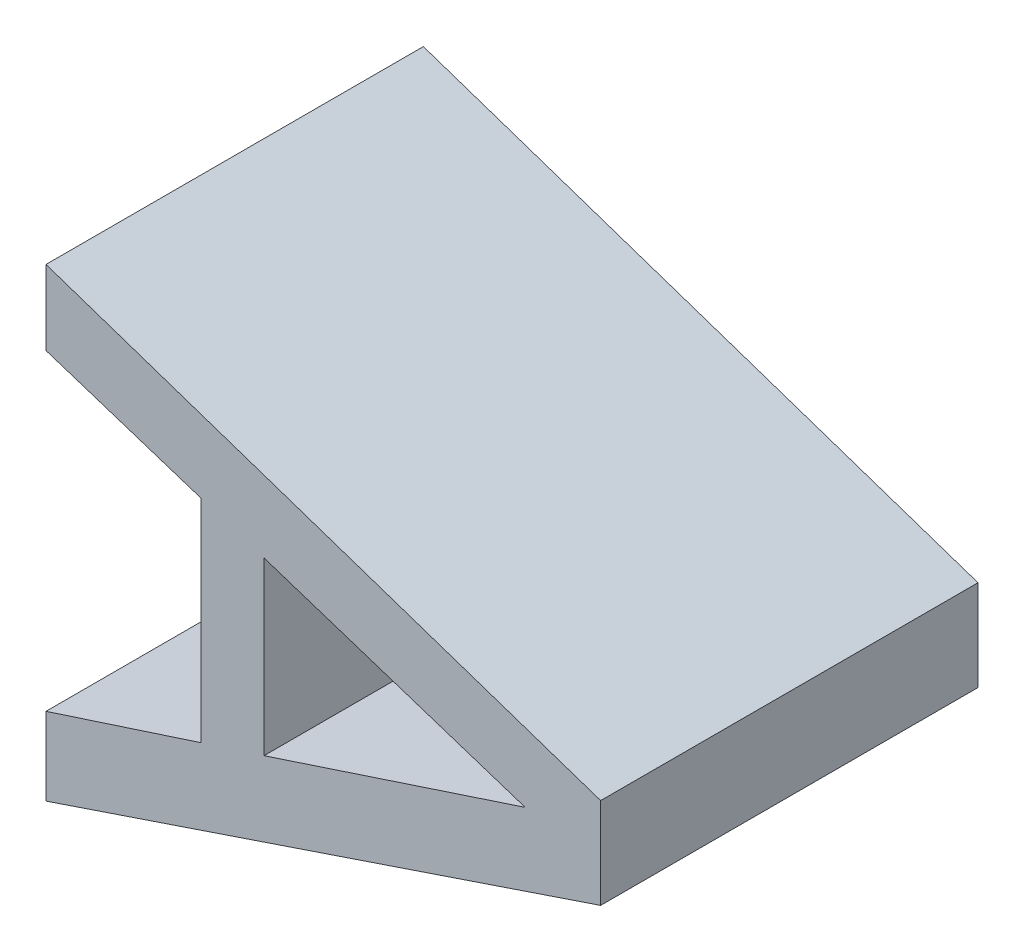
ISO-10303-21;
HEADER;
FILE_DESCRIPTION(('STEP AP214'),'2;1');
FILE_NAME('part.step','',(''),(''),'','','');
FILE_SCHEMA(('AUTOMOTIVE_DESIGN { 1 0 10303 214 1 1 1 1 }'));
ENDSEC;
DATA;
#1=APPLICATION_CONTEXT('core data for automotive mechanical design processes');
#2=APPLICATION_PROTOCOL_DEFINITION('international standard','automotive_design',2000,#1);
#3=PRODUCT_CONTEXT('',#1,'mechanical');
#4=PRODUCT('Part','Part','',(#3));
#5=PRODUCT_RELATED_PRODUCT_CATEGORY('part','',(#4));
#6=PRODUCT_DEFINITION_FORMATION('','',#4);
#7=PRODUCT_DEFINITION_CONTEXT('part definition',#1,'design');
#8=PRODUCT_DEFINITION('design','',#6,#7);
#9=PRODUCT_DEFINITION_SHAPE('','',#8);
#10=(LENGTH_UNIT() NAMED_UNIT(*) SI_UNIT(.MILLI.,.METRE.));
#11=(NAMED_UNIT(*) PLANE_ANGLE_UNIT() SI_UNIT($,.RADIAN.));
#12=(NAMED_UNIT(*) SI_UNIT($,.STERADIAN.) SOLID_ANGLE_UNIT());
#13=UNCERTAINTY_MEASURE_WITH_UNIT(LENGTH_MEASURE(1.E-05),#10,'distance_accuracy_value','');
#14=(GEOMETRIC_REPRESENTATION_CONTEXT(3) GLOBAL_UNCERTAINTY_ASSIGNED_CONTEXT((#13)) GLOBAL_UNIT_ASSIGNED_CONTEXT((#10,
#11,#12)) REPRESENTATION_CONTEXT('',''));
#15=CARTESIAN_POINT('',(0.,0.,0.));
#16=DIRECTION('',(0.,0.,1.));
#17=DIRECTION('',(1.,0.,0.));
#18=AXIS2_PLACEMENT_3D('',#15,#16,#17);
#19=CARTESIAN_POINT('',(-0.14056293363183,-1.23494373197261,0.));
#20=DIRECTION('',(-1.,0.,0.));
#21=DIRECTION('',(0.,-1.,0.));
#22=AXIS2_PLACEMENT_3D('',#19,#20,#21);
#23=PLANE('',#22);
#24=DIRECTION('',(0.,-1.,0.));
#25=VECTOR('',#24,1.);
#26=CARTESIAN_POINT('',(-0.14056293363183,-1.23494373197261,0.));
#27=LINE('',#26,#25);
#28=CARTESIAN_POINT('',(-0.14056293363183,-1.23494373197261,0.));
#29=VERTEX_POINT('',#28);
#30=CARTESIAN_POINT('',(-0.14056293363183,-1.28033028319837,0.));
#31=VERTEX_POINT('',#30);
#32=EDGE_CURVE('E11',#29,#31,#27,.T.);
#33=ORIENTED_EDGE('',*,*,#32,.F.);
#34=DIRECTION('',(0.,0.,1.));
#35=VECTOR('',#34,1.);
#36=CARTESIAN_POINT('',(-0.14056293363183,-1.23494373197261,0.));
#37=LINE('',#36,#35);
#38=CARTESIAN_POINT('',(-0.14056293363183,-1.23494373197261,0.1));
#39=VERTEX_POINT('',#38);
#40=EDGE_CURVE('E190',#29,#39,#37,.T.);
#41=ORIENTED_EDGE('',*,*,#40,.T.);
#42=DIRECTION('',(0.,1.,0.));
#43=VECTOR('',#42,1.);
#44=CARTESIAN_POINT('',(-0.14056293363183,-1.28033028319837,0.1));
#45=LINE('',#44,#43);
#46=CARTESIAN_POINT('',(-0.14056293363183,-1.28033028319837,0.1));
#47=VERTEX_POINT('',#46);
#48=EDGE_CURVE('E182',#47,#39,#45,.T.);
#49=ORIENTED_EDGE('',*,*,#48,.F.);
#50=DIRECTION('',(0.,0.,1.));
#51=VECTOR('',#50,1.);
#52=CARTESIAN_POINT('',(-0.14056293363183,-1.28033028319837,0.));
#53=LINE('',#52,#51);
#54=EDGE_CURVE('E176',#31,#47,#53,.T.);
#55=ORIENTED_EDGE('',*,*,#54,.F.);
#56=EDGE_LOOP('',(#33,#41,#49,#55));
#57=FACE_BOUND('',#56,.T.);
#58=ADVANCED_FACE('F17',(#57),#23,.F.);
#59=CARTESIAN_POINT('',(-0.0713514211327046,-1.2575774451823,0.));
#60=DIRECTION('',(0.310824121666868,0.95046744572869,0.));
#61=DIRECTION('',(-0.95046744572869,0.310824121666868,0.));
#62=AXIS2_PLACEMENT_3D('',#59,#60,#61);
#63=PLANE('',#62);
#64=DIRECTION('',(-0.95046744572869,0.310824121666869,0.));
#65=VECTOR('',#64,1.);
#66=CARTESIAN_POINT('',(-0.0713514211327044,-1.2575774451823,0.));
#67=LINE('',#66,#65);
#68=CARTESIAN_POINT('',(-0.0713514211327046,-1.2575774451823,0.));
#69=VERTEX_POINT('',#68);
#70=EDGE_CURVE('E24',#69,#29,#67,.T.);
#71=ORIENTED_EDGE('',*,*,#70,.F.);
#72=DIRECTION('',(0.,0.,1.));
#73=VECTOR('',#72,1.);
#74=CARTESIAN_POINT('',(-0.0713514211327046,-1.2575774451823,0.));
#75=LINE('',#74,#73);
#76=CARTESIAN_POINT('',(-0.0713514211327046,-1.2575774451823,0.1));
#77=VERTEX_POINT('',#76);
#78=EDGE_CURVE('E185',#69,#77,#75,.T.);
#79=ORIENTED_EDGE('',*,*,#78,.T.);
#80=DIRECTION('',(0.950467445728691,-0.310824121666866,0.));
#81=VECTOR('',#80,1.);
#82=CARTESIAN_POINT('',(-0.140562933631828,-1.2349437319726,0.1));
#83=LINE('',#82,#81);
#84=EDGE_CURVE('E173',#39,#77,#83,.T.);
#85=ORIENTED_EDGE('',*,*,#84,.F.);
#86=ORIENTED_EDGE('',*,*,#40,.F.);
#87=EDGE_LOOP('',(#71,#79,#85,#86));
#88=FACE_BOUND('',#87,.T.);
#89=ADVANCED_FACE('F197',(#88),#63,.F.);
#90=CARTESIAN_POINT('',(-0.14056293363183,-1.28033028319837,0.));
#91=DIRECTION('',(0.312300861312514,-0.949983248285706,0.));
#92=DIRECTION('',(0.949983248285706,0.312300861312514,0.));
#93=AXIS2_PLACEMENT_3D('',#90,#91,#92);
#94=PLANE('',#93);
#95=DIRECTION('',(0.949983248285707,0.312300861312513,0.));
#96=VECTOR('',#95,1.);
#97=CARTESIAN_POINT('',(-0.140562933631831,-1.28033028319837,0.));
#98=LINE('',#97,#96);
#99=EDGE_CURVE('E187',#31,#69,#98,.T.);
#100=ORIENTED_EDGE('',*,*,#99,.F.);
#101=ORIENTED_EDGE('',*,*,#54,.T.);
#102=DIRECTION('',(-0.949983248285706,-0.312300861312515,0.));
#103=VECTOR('',#102,1.);
#104=CARTESIAN_POINT('',(-0.0713514211327036,-1.2575774451823,0.1));
#105=LINE('',#104,#103);
#106=EDGE_CURVE('E165',#77,#47,#105,.T.);
#107=ORIENTED_EDGE('',*,*,#106,.F.);
#108=ORIENTED_EDGE('',*,*,#78,.F.);
#109=EDGE_LOOP('',(#100,#101,#107,#108));
#110=FACE_BOUND('',#109,.T.);
#111=ADVANCED_FACE('F194',(#110),#94,.F.);
#112=CARTESIAN_POINT('',(-0.0513384536630779,-1.27008554985082,0.));
#113=DIRECTION('',(1.,0.,0.));
#114=DIRECTION('',(0.,1.,0.));
#115=AXIS2_PLACEMENT_3D('',#112,#113,#114);
#116=PLANE('',#115);
#117=DIRECTION('',(0.,-1.,0.));
#118=VECTOR('',#117,1.);
#119=CARTESIAN_POINT('',(-0.051338453663078,-1.24602233896472,0.));
#120=LINE('',#119,#118);
#121=CARTESIAN_POINT('',(-0.051338453663078,-1.24602233896472,0.));
#122=VERTEX_POINT('',#121);
#123=CARTESIAN_POINT('',(-0.0513384536630779,-1.27008554985082,0.));
#124=VERTEX_POINT('',#123);
#125=EDGE_CURVE('E179',#122,#124,#120,.T.);
#126=ORIENTED_EDGE('',*,*,#125,.F.);
#127=DIRECTION('',(0.,0.,1.));
#128=VECTOR('',#127,1.);
#129=CARTESIAN_POINT('',(-0.051338453663078,-1.24602233896472,0.));
#130=LINE('',#129,#128);
#131=CARTESIAN_POINT('',(-0.051338453663078,-1.24602233896472,0.1));
#132=VERTEX_POINT('',#131);
#133=EDGE_CURVE('E168',#122,#132,#130,.T.);
#134=ORIENTED_EDGE('',*,*,#133,.T.);
#135=DIRECTION('',(0.,1.,0.));
#136=VECTOR('',#135,1.);
#137=CARTESIAN_POINT('',(-0.0513384536630779,-1.27008554985082,0.1));
#138=LINE('',#137,#136);
#139=CARTESIAN_POINT('',(-0.0513384536630779,-1.27008554985082,0.1));
#140=VERTEX_POINT('',#139);
#141=EDGE_CURVE('E123',#140,#132,#138,.T.);
#142=ORIENTED_EDGE('',*,*,#141,.F.);
#143=DIRECTION('',(0.,0.,1.));
#144=VECTOR('',#143,1.);
#145=CARTESIAN_POINT('',(-0.0513384536630779,-1.27008554985082,0.));
#146=LINE('',#145,#144);
#147=EDGE_CURVE('E160',#124,#140,#146,.T.);
#148=ORIENTED_EDGE('',*,*,#147,.F.);
#149=EDGE_LOOP('',(#126,#134,#142,#148));
#150=FACE_BOUND('',#149,.T.);
#151=ADVANCED_FACE('F204',(#150),#116,.T.);
#152=CARTESIAN_POINT('',(-0.19833846471974,-1.31964146929942,0.));
#153=DIRECTION('',(0.319451166674569,-0.947602739606771,0.));
#154=DIRECTION('',(0.947602739606771,0.319451166674569,0.));
#155=AXIS2_PLACEMENT_3D('',#152,#153,#154);
#156=PLANE('',#155);
#157=DIRECTION('',(-0.94760273960677,-0.319451166674569,0.));
#158=VECTOR('',#157,1.);
#159=CARTESIAN_POINT('',(-0.0513384536630779,-1.27008554985082,0.));
#160=LINE('',#159,#158);
#161=CARTESIAN_POINT('',(-0.198338464719739,-1.31964146929942,0.));
#162=VERTEX_POINT('',#161);
#163=EDGE_CURVE('E170',#124,#162,#160,.T.);
#164=ORIENTED_EDGE('',*,*,#163,.F.);
#165=ORIENTED_EDGE('',*,*,#147,.T.);
#166=DIRECTION('',(0.94760273960677,0.31945116667457,0.));
#167=VECTOR('',#166,1.);
#168=CARTESIAN_POINT('',(-0.198338464719739,-1.31964146929942,0.1));
#169=LINE('',#168,#167);
#170=CARTESIAN_POINT('',(-0.198338464719739,-1.31964146929942,0.1));
#171=VERTEX_POINT('',#170);
#172=EDGE_CURVE('E152',#171,#140,#169,.T.);
#173=ORIENTED_EDGE('',*,*,#172,.F.);
#174=DIRECTION('',(0.,0.,1.));
#175=VECTOR('',#174,1.);
#176=CARTESIAN_POINT('',(-0.198338464719739,-1.31964146929942,0.));
#177=LINE('',#176,#175);
#178=EDGE_CURVE('E154',#162,#171,#177,.T.);
#179=ORIENTED_EDGE('',*,*,#178,.F.);
#180=EDGE_LOOP('',(#164,#165,#173,#179));
#181=FACE_BOUND('',#180,.T.);
#182=ADVANCED_FACE('F212',(#181),#156,.T.);
#183=CARTESIAN_POINT('',(-0.198338464719739,-1.29903287779796,0.));
#184=DIRECTION('',(-1.,0.,0.));
#185=DIRECTION('',(0.,-1.,0.));
#186=AXIS2_PLACEMENT_3D('',#183,#184,#185);
#187=PLANE('',#186);
#188=DIRECTION('',(0.,1.,0.));
#189=VECTOR('',#188,1.);
#190=CARTESIAN_POINT('',(-0.198338464719739,-1.31964146929942,0.));
#191=LINE('',#190,#189);
#192=CARTESIAN_POINT('',(-0.198338464719739,-1.29903287779796,0.));
#193=VERTEX_POINT('',#192);
#194=EDGE_CURVE('E162',#162,#193,#191,.T.);
#195=ORIENTED_EDGE('',*,*,#194,.F.);
#196=ORIENTED_EDGE('',*,*,#178,.T.);
#197=DIRECTION('',(0.,-1.,0.));
#198=VECTOR('',#197,1.);
#199=CARTESIAN_POINT('',(-0.198338464719739,-1.29903287779796,0.1));
#200=LINE('',#199,#198);
#201=CARTESIAN_POINT('',(-0.198338464719739,-1.29903287779796,0.1));
#202=VERTEX_POINT('',#201);
#203=EDGE_CURVE('E144',#202,#171,#200,.T.);
#204=ORIENTED_EDGE('',*,*,#203,.F.);
#205=DIRECTION('',(0.,0.,1.));
#206=VECTOR('',#205,1.);
#207=CARTESIAN_POINT('',(-0.198338464719739,-1.29903287779796,0.));
#208=LINE('',#207,#206);
#209=EDGE_CURVE('E147',#193,#202,#208,.T.);
#210=ORIENTED_EDGE('',*,*,#209,.F.);
#211=EDGE_LOOP('',(#195,#196,#204,#210));
#212=FACE_BOUND('',#211,.T.);
#213=ADVANCED_FACE('F218',(#212),#187,.T.);
#214=CARTESIAN_POINT('',(-0.157240406523185,-1.28569089948487,0.));
#215=DIRECTION('',(-0.308774363938383,0.951135317488761,0.));
#216=DIRECTION('',(-0.951135317488761,-0.308774363938383,0.));
#217=AXIS2_PLACEMENT_3D('',#214,#215,#216);
#218=PLANE('',#217);
#219=DIRECTION('',(0.951135317488763,0.308774363938377,0.));
#220=VECTOR('',#219,1.);
#221=CARTESIAN_POINT('',(-0.198338464719739,-1.29903287779796,0.));
#222=LINE('',#221,#220);
#223=CARTESIAN_POINT('',(-0.157240406523185,-1.28569089948487,0.));
#224=VERTEX_POINT('',#223);
#225=EDGE_CURVE('E156',#193,#224,#222,.T.);
#226=ORIENTED_EDGE('',*,*,#225,.F.);
#227=ORIENTED_EDGE('',*,*,#209,.T.);
#228=DIRECTION('',(-0.951135317488762,-0.308774363938382,0.));
#229=VECTOR('',#228,1.);
#230=CARTESIAN_POINT('',(-0.157240406523183,-1.28569089948488,0.1));
#231=LINE('',#230,#229);
#232=CARTESIAN_POINT('',(-0.157240406523185,-1.28569089948487,0.1));
#233=VERTEX_POINT('',#232);
#234=EDGE_CURVE('E136',#233,#202,#231,.T.);
#235=ORIENTED_EDGE('',*,*,#234,.F.);
#236=DIRECTION('',(0.,0.,1.));
#237=VECTOR('',#236,1.);
#238=CARTESIAN_POINT('',(-0.157240406523185,-1.28569089948487,0.));
#239=LINE('',#238,#237);
#240=EDGE_CURVE('E139',#224,#233,#239,.T.);
#241=ORIENTED_EDGE('',*,*,#240,.F.);
#242=EDGE_LOOP('',(#226,#227,#235,#241));
#243=FACE_BOUND('',#242,.T.);
#244=ADVANCED_FACE('F222',(#243),#218,.T.);
#245=CARTESIAN_POINT('',(-0.157240406523185,-1.2295831156861,0.));
#246=DIRECTION('',(-1.,0.,0.));
#247=DIRECTION('',(0.,-1.,0.));
#248=AXIS2_PLACEMENT_3D('',#245,#246,#247);
#249=PLANE('',#248);
#250=DIRECTION('',(0.,1.,0.));
#251=VECTOR('',#250,1.);
#252=CARTESIAN_POINT('',(-0.157240406523185,-1.28569089948487,0.));
#253=LINE('',#252,#251);
#254=CARTESIAN_POINT('',(-0.157240406523185,-1.2295831156861,0.));
#255=VERTEX_POINT('',#254);
#256=EDGE_CURVE('E149',#224,#255,#253,.T.);
#257=ORIENTED_EDGE('',*,*,#256,.F.);
#258=ORIENTED_EDGE('',*,*,#240,.T.);
#259=DIRECTION('',(0.,-1.,0.));
#260=VECTOR('',#259,1.);
#261=CARTESIAN_POINT('',(-0.157240406523185,-1.2295831156861,0.1));
#262=LINE('',#261,#260);
#263=CARTESIAN_POINT('',(-0.157240406523185,-1.2295831156861,0.1));
#264=VERTEX_POINT('',#263);
#265=EDGE_CURVE('E129',#264,#233,#262,.T.);
#266=ORIENTED_EDGE('',*,*,#265,.F.);
#267=DIRECTION('',(0.,0.,1.));
#268=VECTOR('',#267,1.);
#269=CARTESIAN_POINT('',(-0.157240406523185,-1.2295831156861,0.));
#270=LINE('',#269,#268);
#271=EDGE_CURVE('E132',#255,#264,#270,.T.);
#272=ORIENTED_EDGE('',*,*,#271,.F.);
#273=EDGE_LOOP('',(#257,#258,#266,#272));
#274=FACE_BOUND('',#273,.T.);
#275=ADVANCED_FACE('F228',(#274),#249,.T.);
#276=CARTESIAN_POINT('',(-0.19833846471974,-1.21624113737302,0.));
#277=DIRECTION('',(-0.308774363938377,-0.951135317488764,0.));
#278=DIRECTION('',(0.951135317488764,-0.308774363938377,0.));
#279=AXIS2_PLACEMENT_3D('',#276,#277,#278);
#280=PLANE('',#279);
#281=DIRECTION('',(-0.951135317488763,0.308774363938377,0.));
#282=VECTOR('',#281,1.);
#283=CARTESIAN_POINT('',(-0.157240406523185,-1.2295831156861,0.));
#284=LINE('',#283,#282);
#285=CARTESIAN_POINT('',(-0.19833846471974,-1.21624113737302,0.));
#286=VERTEX_POINT('',#285);
#287=EDGE_CURVE('E141',#255,#286,#284,.T.);
#288=ORIENTED_EDGE('',*,*,#287,.F.);
#289=ORIENTED_EDGE('',*,*,#271,.T.);
#290=DIRECTION('',(0.951135317488765,-0.308774363938372,0.));
#291=VECTOR('',#290,1.);
#292=CARTESIAN_POINT('',(-0.198338464719739,-1.21624113737302,0.1));
#293=LINE('',#292,#291);
#294=CARTESIAN_POINT('',(-0.19833846471974,-1.21624113737302,0.1));
#295=VERTEX_POINT('',#294);
#296=EDGE_CURVE('E108',#295,#264,#293,.T.);
#297=ORIENTED_EDGE('',*,*,#296,.F.);
#298=DIRECTION('',(0.,0.,1.));
#299=VECTOR('',#298,1.);
#300=CARTESIAN_POINT('',(-0.19833846471974,-1.21624113737302,0.));
#301=LINE('',#300,#299);
#302=EDGE_CURVE('E114',#286,#295,#301,.T.);
#303=ORIENTED_EDGE('',*,*,#302,.F.);
#304=EDGE_LOOP('',(#288,#289,#297,#303));
#305=FACE_BOUND('',#304,.T.);
#306=ADVANCED_FACE('F232',(#305),#280,.T.);
#307=CARTESIAN_POINT('',(-0.19833846471974,-1.19646641951612,0.));
#308=DIRECTION('',(-1.,0.,0.));
#309=DIRECTION('',(0.,-1.,0.));
#310=AXIS2_PLACEMENT_3D('',#307,#308,#309);
#311=PLANE('',#310);
#312=DIRECTION('',(0.,1.,0.));
#313=VECTOR('',#312,1.);
#314=CARTESIAN_POINT('',(-0.19833846471974,-1.21624113737302,0.));
#315=LINE('',#314,#313);
#316=CARTESIAN_POINT('',(-0.19833846471974,-1.19646641951612,0.));
#317=VERTEX_POINT('',#316);
#318=EDGE_CURVE('E134',#286,#317,#315,.T.);
#319=ORIENTED_EDGE('',*,*,#318,.F.);
#320=ORIENTED_EDGE('',*,*,#302,.T.);
#321=DIRECTION('',(0.,-1.,0.));
#322=VECTOR('',#321,1.);
#323=CARTESIAN_POINT('',(-0.19833846471974,-1.19646641951612,0.1));
#324=LINE('',#323,#322);
#325=CARTESIAN_POINT('',(-0.19833846471974,-1.19646641951612,0.1));
#326=VERTEX_POINT('',#325);
#327=EDGE_CURVE('E109',#326,#295,#324,.T.);
#328=ORIENTED_EDGE('',*,*,#327,.F.);
#329=DIRECTION('',(0.,0.,1.));
#330=VECTOR('',#329,1.);
#331=CARTESIAN_POINT('',(-0.19833846471974,-1.19646641951612,0.));
#332=LINE('',#331,#330);
#333=EDGE_CURVE('E97',#317,#326,#332,.T.);
#334=ORIENTED_EDGE('',*,*,#333,.F.);
#335=EDGE_LOOP('',(#319,#320,#328,#334));
#336=FACE_BOUND('',#335,.T.);
#337=ADVANCED_FACE('F112',(#336),#311,.T.);
#338=CARTESIAN_POINT('',(-0.051338453663078,-1.24602233896472,0.));
#339=DIRECTION('',(0.319451166674565,0.947602739606772,0.));
#340=DIRECTION('',(-0.947602739606772,0.319451166674565,0.));
#341=AXIS2_PLACEMENT_3D('',#338,#339,#340);
#342=PLANE('',#341);
#343=DIRECTION('',(0.947602739606772,-0.319451166674565,0.));
#344=VECTOR('',#343,1.);
#345=CARTESIAN_POINT('',(-0.19833846471974,-1.19646641951612,0.));
#346=LINE('',#345,#344);
#347=EDGE_CURVE('E105',#317,#122,#346,.T.);
#348=ORIENTED_EDGE('',*,*,#347,.F.);
#349=ORIENTED_EDGE('',*,*,#333,.T.);
#350=DIRECTION('',(-0.947602739606771,0.319451166674566,0.));
#351=VECTOR('',#350,1.);
#352=CARTESIAN_POINT('',(-0.0513384536630777,-1.24602233896472,0.1));
#353=LINE('',#352,#351);
#354=EDGE_CURVE('E102',#132,#326,#353,.T.);
#355=ORIENTED_EDGE('',*,*,#354,.F.);
#356=ORIENTED_EDGE('',*,*,#133,.F.);
#357=EDGE_LOOP('',(#348,#349,#355,#356));
#358=FACE_BOUND('',#357,.T.);
#359=ADVANCED_FACE('F99',(#358),#342,.T.);
#360=CARTESIAN_POINT('',(-0.139519545885032,-1.25800579228048,0.));
#361=DIRECTION('',(0.,0.,1.));
#362=DIRECTION('',(1.,0.,0.));
#363=AXIS2_PLACEMENT_3D('',#360,#361,#362);
#364=PLANE('',#363);
#365=ORIENTED_EDGE('',*,*,#347,.T.);
#366=ORIENTED_EDGE('',*,*,#125,.T.);
#367=ORIENTED_EDGE('',*,*,#163,.T.);
#368=ORIENTED_EDGE('',*,*,#194,.T.);
#369=ORIENTED_EDGE('',*,*,#225,.T.);
#370=ORIENTED_EDGE('',*,*,#256,.T.);
#371=ORIENTED_EDGE('',*,*,#287,.T.);
#372=ORIENTED_EDGE('',*,*,#318,.T.);
#373=EDGE_LOOP('',(#365,#366,#367,#368,#369,#370,#371,#372));
#374=FACE_BOUND('',#373,.T.);
#375=ORIENTED_EDGE('',*,*,#32,.T.);
#376=ORIENTED_EDGE('',*,*,#99,.T.);
#377=ORIENTED_EDGE('',*,*,#70,.T.);
#378=EDGE_LOOP('',(#375,#376,#377));
#379=FACE_BOUND('',#378,.T.);
#380=ADVANCED_FACE('F192',(#374,#379),#364,.F.);
#381=CARTESIAN_POINT('',(-0.139519545885032,-1.25800579228048,0.1));
#382=DIRECTION('',(0.,0.,1.));
#383=DIRECTION('',(1.,0.,0.));
#384=AXIS2_PLACEMENT_3D('',#381,#382,#383);
#385=PLANE('',#384);
#386=ORIENTED_EDGE('',*,*,#354,.T.);
#387=ORIENTED_EDGE('',*,*,#327,.T.);
#388=ORIENTED_EDGE('',*,*,#296,.T.);
#389=ORIENTED_EDGE('',*,*,#265,.T.);
#390=ORIENTED_EDGE('',*,*,#234,.T.);
#391=ORIENTED_EDGE('',*,*,#203,.T.);
#392=ORIENTED_EDGE('',*,*,#172,.T.);
#393=ORIENTED_EDGE('',*,*,#141,.T.);
#394=EDGE_LOOP('',(#386,#387,#388,#389,#390,#391,#392,#393));
#395=FACE_BOUND('',#394,.T.);
#396=ORIENTED_EDGE('',*,*,#48,.T.);
#397=ORIENTED_EDGE('',*,*,#84,.T.);
#398=ORIENTED_EDGE('',*,*,#106,.T.);
#399=EDGE_LOOP('',(#396,#397,#398));
#400=FACE_BOUND('',#399,.T.);
#401=ADVANCED_FACE('F119',(#395,#400),#385,.T.);
#402=CLOSED_SHELL('',(#58,#89,#111,#151,#182,#213,#244,#275,#306,#337,#359,#380,#401));
#403=MANIFOLD_SOLID_BREP('B1',#402);
#404=ADVANCED_BREP_SHAPE_REPRESENTATION('',(#18,#403),#14);
#405=SHAPE_DEFINITION_REPRESENTATION(#9,#404);
ENDSEC;
END-ISO-10303-21;
